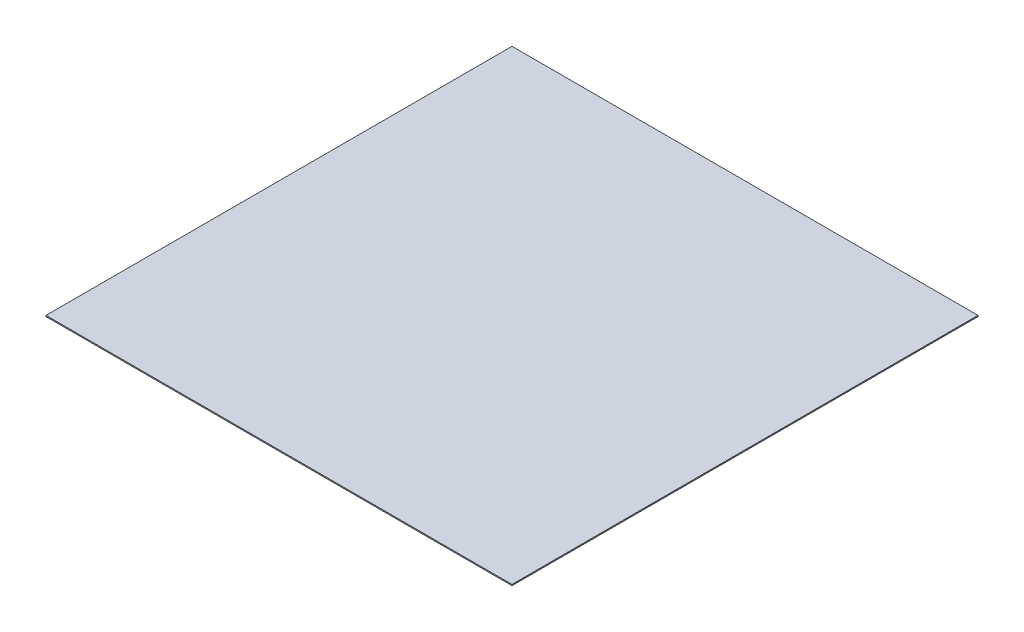
ISO-10303-21;
HEADER;
FILE_DESCRIPTION(('STEP AP214'),'2;1');
FILE_NAME('part.step','',(''),(''),'','','');
FILE_SCHEMA(('AUTOMOTIVE_DESIGN { 1 0 10303 214 1 1 1 1 }'));
ENDSEC;
DATA;
#1=APPLICATION_CONTEXT('core data for automotive mechanical design processes');
#2=APPLICATION_PROTOCOL_DEFINITION('international standard','automotive_design',2000,#1);
#3=PRODUCT_CONTEXT('',#1,'mechanical');
#4=PRODUCT('Part','Part','',(#3));
#5=PRODUCT_RELATED_PRODUCT_CATEGORY('part','',(#4));
#6=PRODUCT_DEFINITION_FORMATION('','',#4);
#7=PRODUCT_DEFINITION_CONTEXT('part definition',#1,'design');
#8=PRODUCT_DEFINITION('design','',#6,#7);
#9=PRODUCT_DEFINITION_SHAPE('','',#8);
#10=(LENGTH_UNIT() NAMED_UNIT(*) SI_UNIT(.MILLI.,.METRE.));
#11=(NAMED_UNIT(*) PLANE_ANGLE_UNIT() SI_UNIT($,.RADIAN.));
#12=(NAMED_UNIT(*) SI_UNIT($,.STERADIAN.) SOLID_ANGLE_UNIT());
#13=UNCERTAINTY_MEASURE_WITH_UNIT(LENGTH_MEASURE(1.E-05),#10,'distance_accuracy_value','');
#14=(GEOMETRIC_REPRESENTATION_CONTEXT(3) GLOBAL_UNCERTAINTY_ASSIGNED_CONTEXT((#13)) GLOBAL_UNIT_ASSIGNED_CONTEXT((#10,
#11,#12)) REPRESENTATION_CONTEXT('',''));
#15=CARTESIAN_POINT('',(0.,0.,0.));
#16=DIRECTION('',(0.,0.,1.));
#17=DIRECTION('',(1.,0.,0.));
#18=AXIS2_PLACEMENT_3D('',#15,#16,#17);
#19=CARTESIAN_POINT('',(0.,0.5,0.));
#20=DIRECTION('',(1.,0.,0.));
#21=DIRECTION('',(0.,0.,-1.));
#22=AXIS2_PLACEMENT_3D('',#19,#20,#21);
#23=PLANE('',#22);
#24=DIRECTION('',(0.,0.,1.));
#25=VECTOR('',#24,1.);
#26=CARTESIAN_POINT('',(0.,0.,0.));
#27=LINE('',#26,#25);
#28=CARTESIAN_POINT('',(0.,0.,-210.));
#29=VERTEX_POINT('',#28);
#30=CARTESIAN_POINT('',(0.,0.,0.));
#31=VERTEX_POINT('',#30);
#32=EDGE_CURVE('E98',#29,#31,#27,.T.);
#33=ORIENTED_EDGE('',*,*,#32,.T.);
#34=DIRECTION('',(0.,-1.,0.));
#35=VECTOR('',#34,1.);
#36=CARTESIAN_POINT('',(0.,0.5,0.));
#37=LINE('',#36,#35);
#38=CARTESIAN_POINT('',(0.,0.5,0.));
#39=VERTEX_POINT('',#38);
#40=EDGE_CURVE('E11',#39,#31,#37,.T.);
#41=ORIENTED_EDGE('',*,*,#40,.F.);
#42=DIRECTION('',(0.,0.,1.));
#43=VECTOR('',#42,1.);
#44=CARTESIAN_POINT('',(0.,0.5,0.));
#45=LINE('',#44,#43);
#46=CARTESIAN_POINT('',(0.,0.5,-210.));
#47=VERTEX_POINT('',#46);
#48=EDGE_CURVE('E86',#47,#39,#45,.T.);
#49=ORIENTED_EDGE('',*,*,#48,.F.);
#50=DIRECTION('',(0.,-1.,0.));
#51=VECTOR('',#50,1.);
#52=CARTESIAN_POINT('',(0.,0.5,-210.));
#53=LINE('',#52,#51);
#54=EDGE_CURVE('E94',#47,#29,#53,.T.);
#55=ORIENTED_EDGE('',*,*,#54,.T.);
#56=EDGE_LOOP('',(#33,#41,#49,#55));
#57=FACE_BOUND('',#56,.T.);
#58=ADVANCED_FACE('F35',(#57),#23,.F.);
#59=CARTESIAN_POINT('',(0.,0.5,0.));
#60=DIRECTION('',(0.,0.,-1.));
#61=DIRECTION('',(-1.,0.,0.));
#62=AXIS2_PLACEMENT_3D('',#59,#60,#61);
#63=PLANE('',#62);
#64=DIRECTION('',(1.,0.,0.));
#65=VECTOR('',#64,1.);
#66=CARTESIAN_POINT('',(0.,0.,0.));
#67=LINE('',#66,#65);
#68=CARTESIAN_POINT('',(210.,0.,0.));
#69=VERTEX_POINT('',#68);
#70=EDGE_CURVE('E90',#31,#69,#67,.T.);
#71=ORIENTED_EDGE('',*,*,#70,.T.);
#72=DIRECTION('',(0.,-1.,0.));
#73=VECTOR('',#72,1.);
#74=CARTESIAN_POINT('',(210.,0.5,0.));
#75=LINE('',#74,#73);
#76=CARTESIAN_POINT('',(210.,0.5,0.));
#77=VERTEX_POINT('',#76);
#78=EDGE_CURVE('E43',#77,#69,#75,.T.);
#79=ORIENTED_EDGE('',*,*,#78,.F.);
#80=DIRECTION('',(1.,0.,0.));
#81=VECTOR('',#80,1.);
#82=CARTESIAN_POINT('',(0.,0.5,0.));
#83=LINE('',#82,#81);
#84=EDGE_CURVE('E81',#39,#77,#83,.T.);
#85=ORIENTED_EDGE('',*,*,#84,.F.);
#86=ORIENTED_EDGE('',*,*,#40,.T.);
#87=EDGE_LOOP('',(#71,#79,#85,#86));
#88=FACE_BOUND('',#87,.T.);
#89=ADVANCED_FACE('F89',(#88),#63,.F.);
#90=CARTESIAN_POINT('',(210.,0.5,0.));
#91=DIRECTION('',(-1.,0.,0.));
#92=DIRECTION('',(0.,0.,1.));
#93=AXIS2_PLACEMENT_3D('',#90,#91,#92);
#94=PLANE('',#93);
#95=DIRECTION('',(0.,0.,-1.));
#96=VECTOR('',#95,1.);
#97=CARTESIAN_POINT('',(210.,0.,0.));
#98=LINE('',#97,#96);
#99=CARTESIAN_POINT('',(210.,0.,-210.));
#100=VERTEX_POINT('',#99);
#101=EDGE_CURVE('E68',#69,#100,#98,.T.);
#102=ORIENTED_EDGE('',*,*,#101,.T.);
#103=DIRECTION('',(0.,-1.,0.));
#104=VECTOR('',#103,1.);
#105=CARTESIAN_POINT('',(210.,0.5,-210.));
#106=LINE('',#105,#104);
#107=CARTESIAN_POINT('',(210.,0.5,-210.));
#108=VERTEX_POINT('',#107);
#109=EDGE_CURVE('E91',#108,#100,#106,.T.);
#110=ORIENTED_EDGE('',*,*,#109,.F.);
#111=DIRECTION('',(0.,0.,-1.));
#112=VECTOR('',#111,1.);
#113=CARTESIAN_POINT('',(210.,0.5,0.));
#114=LINE('',#113,#112);
#115=EDGE_CURVE('E84',#77,#108,#114,.T.);
#116=ORIENTED_EDGE('',*,*,#115,.F.);
#117=ORIENTED_EDGE('',*,*,#78,.T.);
#118=EDGE_LOOP('',(#102,#110,#116,#117));
#119=FACE_BOUND('',#118,.T.);
#120=ADVANCED_FACE('F92',(#119),#94,.F.);
#121=CARTESIAN_POINT('',(0.,0.5,-210.));
#122=DIRECTION('',(0.,0.,1.));
#123=DIRECTION('',(1.,0.,0.));
#124=AXIS2_PLACEMENT_3D('',#121,#122,#123);
#125=PLANE('',#124);
#126=DIRECTION('',(-1.,0.,0.));
#127=VECTOR('',#126,1.);
#128=CARTESIAN_POINT('',(0.,0.,-210.));
#129=LINE('',#128,#127);
#130=EDGE_CURVE('E74',#100,#29,#129,.T.);
#131=ORIENTED_EDGE('',*,*,#130,.T.);
#132=ORIENTED_EDGE('',*,*,#54,.F.);
#133=DIRECTION('',(-1.,0.,0.));
#134=VECTOR('',#133,1.);
#135=CARTESIAN_POINT('',(0.,0.5,-210.));
#136=LINE('',#135,#134);
#137=EDGE_CURVE('E51',#108,#47,#136,.T.);
#138=ORIENTED_EDGE('',*,*,#137,.F.);
#139=ORIENTED_EDGE('',*,*,#109,.T.);
#140=EDGE_LOOP('',(#131,#132,#138,#139));
#141=FACE_BOUND('',#140,.T.);
#142=ADVANCED_FACE('F105',(#141),#125,.F.);
#143=CARTESIAN_POINT('',(0.,0.5,0.));
#144=DIRECTION('',(0.,-1.,0.));
#145=DIRECTION('',(0.,0.,-1.));
#146=AXIS2_PLACEMENT_3D('',#143,#144,#145);
#147=PLANE('',#146);
#148=ORIENTED_EDGE('',*,*,#48,.T.);
#149=ORIENTED_EDGE('',*,*,#84,.T.);
#150=ORIENTED_EDGE('',*,*,#115,.T.);
#151=ORIENTED_EDGE('',*,*,#137,.T.);
#152=EDGE_LOOP('',(#148,#149,#150,#151));
#153=FACE_BOUND('',#152,.T.);
#154=ADVANCED_FACE('F82',(#153),#147,.F.);
#155=CARTESIAN_POINT('',(0.,0.,0.));
#156=DIRECTION('',(0.,-1.,0.));
#157=DIRECTION('',(0.,0.,-1.));
#158=AXIS2_PLACEMENT_3D('',#155,#156,#157);
#159=PLANE('',#158);
#160=ORIENTED_EDGE('',*,*,#32,.F.);
#161=ORIENTED_EDGE('',*,*,#130,.F.);
#162=ORIENTED_EDGE('',*,*,#101,.F.);
#163=ORIENTED_EDGE('',*,*,#70,.F.);
#164=EDGE_LOOP('',(#160,#161,#162,#163));
#165=FACE_BOUND('',#164,.T.);
#166=ADVANCED_FACE('F108',(#165),#159,.T.);
#167=CLOSED_SHELL('',(#58,#89,#120,#142,#154,#166));
#168=MANIFOLD_SOLID_BREP('B2',#167);
#169=ADVANCED_BREP_SHAPE_REPRESENTATION('',(#18,#168),#14);
#170=SHAPE_DEFINITION_REPRESENTATION(#9,#169);
ENDSEC;
END-ISO-10303-21;
